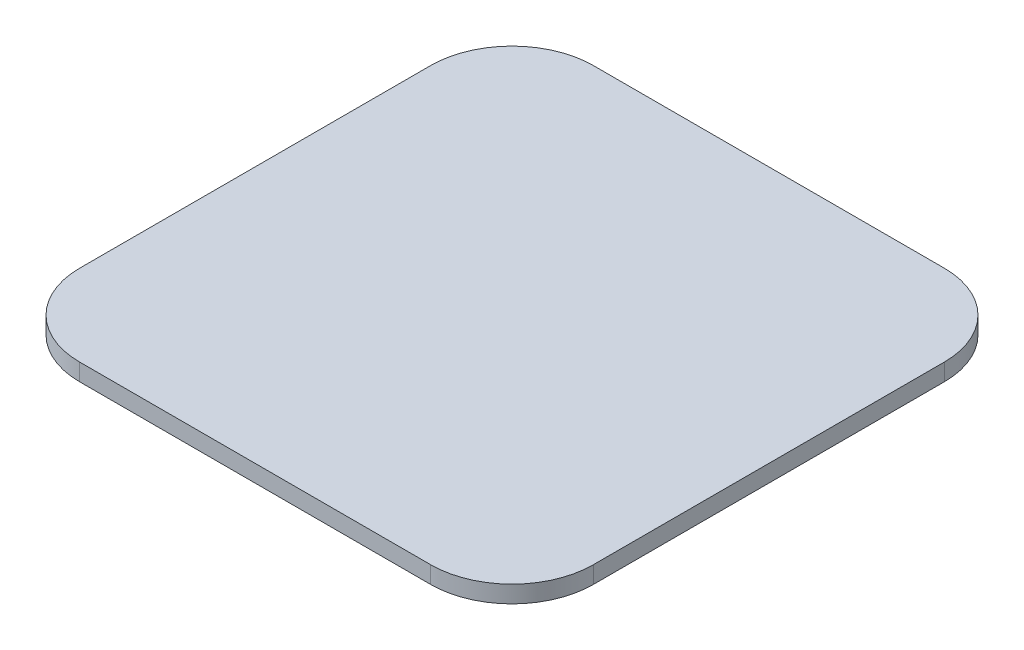
ISO-10303-21;
HEADER;
FILE_DESCRIPTION(('STEP AP214'),'2;1');
FILE_NAME('part.step','',(''),(''),'','','');
FILE_SCHEMA(('AUTOMOTIVE_DESIGN { 1 0 10303 214 1 1 1 1 }'));
ENDSEC;
DATA;
#1=APPLICATION_CONTEXT('core data for automotive mechanical design processes');
#2=APPLICATION_PROTOCOL_DEFINITION('international standard','automotive_design',2000,#1);
#3=PRODUCT_CONTEXT('',#1,'mechanical');
#4=PRODUCT('Part','Part','',(#3));
#5=PRODUCT_RELATED_PRODUCT_CATEGORY('part','',(#4));
#6=PRODUCT_DEFINITION_FORMATION('','',#4);
#7=PRODUCT_DEFINITION_CONTEXT('part definition',#1,'design');
#8=PRODUCT_DEFINITION('design','',#6,#7);
#9=PRODUCT_DEFINITION_SHAPE('','',#8);
#10=(LENGTH_UNIT() NAMED_UNIT(*) SI_UNIT(.MILLI.,.METRE.));
#11=(NAMED_UNIT(*) PLANE_ANGLE_UNIT() SI_UNIT($,.RADIAN.));
#12=(NAMED_UNIT(*) SI_UNIT($,.STERADIAN.) SOLID_ANGLE_UNIT());
#13=UNCERTAINTY_MEASURE_WITH_UNIT(LENGTH_MEASURE(1.E-05),#10,'distance_accuracy_value','');
#14=(GEOMETRIC_REPRESENTATION_CONTEXT(3) GLOBAL_UNCERTAINTY_ASSIGNED_CONTEXT((#13)) GLOBAL_UNIT_ASSIGNED_CONTEXT((#10,
#11,#12)) REPRESENTATION_CONTEXT('',''));
#15=CARTESIAN_POINT('',(0.,0.,0.));
#16=DIRECTION('',(0.,0.,1.));
#17=DIRECTION('',(1.,0.,0.));
#18=AXIS2_PLACEMENT_3D('',#15,#16,#17);
#19=CARTESIAN_POINT('',(0.,4.,0.));
#20=DIRECTION('',(1.,0.,0.));
#21=DIRECTION('',(0.,0.,-1.));
#22=AXIS2_PLACEMENT_3D('',#19,#20,#21);
#23=PLANE('',#22);
#24=DIRECTION('',(0.,0.,1.));
#25=VECTOR('',#24,1.);
#26=CARTESIAN_POINT('',(0.,4.,0.));
#27=LINE('',#26,#25);
#28=CARTESIAN_POINT('',(0.,4.,-101.));
#29=VERTEX_POINT('',#28);
#30=CARTESIAN_POINT('',(0.,4.,-19.));
#31=VERTEX_POINT('',#30);
#32=EDGE_CURVE('E117',#29,#31,#27,.T.);
#33=ORIENTED_EDGE('',*,*,#32,.F.);
#34=DIRECTION('',(0.,-1.,0.));
#35=VECTOR('',#34,1.);
#36=CARTESIAN_POINT('',(0.,4.,-101.));
#37=LINE('',#36,#35);
#38=CARTESIAN_POINT('',(0.,0.,-101.));
#39=VERTEX_POINT('',#38);
#40=EDGE_CURVE('E102',#29,#39,#37,.T.);
#41=ORIENTED_EDGE('',*,*,#40,.T.);
#42=DIRECTION('',(0.,0.,1.));
#43=VECTOR('',#42,1.);
#44=CARTESIAN_POINT('',(0.,0.,0.));
#45=LINE('',#44,#43);
#46=CARTESIAN_POINT('',(0.,0.,-19.));
#47=VERTEX_POINT('',#46);
#48=EDGE_CURVE('E114',#39,#47,#45,.T.);
#49=ORIENTED_EDGE('',*,*,#48,.T.);
#50=DIRECTION('',(0.,-1.,0.));
#51=VECTOR('',#50,1.);
#52=CARTESIAN_POINT('',(0.,4.,-19.));
#53=LINE('',#52,#51);
#54=EDGE_CURVE('E119',#47,#31,#53,.F.);
#55=ORIENTED_EDGE('',*,*,#54,.T.);
#56=EDGE_LOOP('',(#33,#41,#49,#55));
#57=FACE_BOUND('',#56,.T.);
#58=ADVANCED_FACE('F32',(#57),#23,.F.);
#59=CARTESIAN_POINT('',(0.,4.,0.));
#60=DIRECTION('',(0.,0.,-1.));
#61=DIRECTION('',(-1.,0.,0.));
#62=AXIS2_PLACEMENT_3D('',#59,#60,#61);
#63=PLANE('',#62);
#64=DIRECTION('',(1.,0.,0.));
#65=VECTOR('',#64,1.);
#66=CARTESIAN_POINT('',(0.,0.,0.));
#67=LINE('',#66,#65);
#68=CARTESIAN_POINT('',(19.,0.,0.));
#69=VERTEX_POINT('',#68);
#70=CARTESIAN_POINT('',(101.,0.,0.));
#71=VERTEX_POINT('',#70);
#72=EDGE_CURVE('E123',#69,#71,#67,.T.);
#73=ORIENTED_EDGE('',*,*,#72,.T.);
#74=DIRECTION('',(0.,-1.,0.));
#75=VECTOR('',#74,1.);
#76=CARTESIAN_POINT('',(101.,4.,0.));
#77=LINE('',#76,#75);
#78=CARTESIAN_POINT('',(101.,4.,0.));
#79=VERTEX_POINT('',#78);
#80=EDGE_CURVE('E11',#71,#79,#77,.F.);
#81=ORIENTED_EDGE('',*,*,#80,.T.);
#82=DIRECTION('',(1.,0.,0.));
#83=VECTOR('',#82,1.);
#84=CARTESIAN_POINT('',(0.,4.,0.));
#85=LINE('',#84,#83);
#86=CARTESIAN_POINT('',(19.,4.,0.));
#87=VERTEX_POINT('',#86);
#88=EDGE_CURVE('E159',#87,#79,#85,.T.);
#89=ORIENTED_EDGE('',*,*,#88,.F.);
#90=DIRECTION('',(0.,-1.,0.));
#91=VECTOR('',#90,1.);
#92=CARTESIAN_POINT('',(19.,4.,0.));
#93=LINE('',#92,#91);
#94=EDGE_CURVE('E40',#87,#69,#93,.T.);
#95=ORIENTED_EDGE('',*,*,#94,.T.);
#96=EDGE_LOOP('',(#73,#81,#89,#95));
#97=FACE_BOUND('',#96,.T.);
#98=ADVANCED_FACE('F157',(#97),#63,.F.);
#99=CARTESIAN_POINT('',(120.,4.,0.));
#100=DIRECTION('',(-1.,0.,0.));
#101=DIRECTION('',(0.,0.,1.));
#102=AXIS2_PLACEMENT_3D('',#99,#100,#101);
#103=PLANE('',#102);
#104=DIRECTION('',(0.,0.,-1.));
#105=VECTOR('',#104,1.);
#106=CARTESIAN_POINT('',(120.,0.,0.));
#107=LINE('',#106,#105);
#108=CARTESIAN_POINT('',(120.,0.,-19.));
#109=VERTEX_POINT('',#108);
#110=CARTESIAN_POINT('',(120.,0.,-101.));
#111=VERTEX_POINT('',#110);
#112=EDGE_CURVE('E126',#109,#111,#107,.T.);
#113=ORIENTED_EDGE('',*,*,#112,.T.);
#114=DIRECTION('',(0.,-1.,0.));
#115=VECTOR('',#114,1.);
#116=CARTESIAN_POINT('',(120.,4.,-101.));
#117=LINE('',#116,#115);
#118=CARTESIAN_POINT('',(120.,4.,-101.));
#119=VERTEX_POINT('',#118);
#120=EDGE_CURVE('E47',#111,#119,#117,.F.);
#121=ORIENTED_EDGE('',*,*,#120,.T.);
#122=DIRECTION('',(0.,0.,-1.));
#123=VECTOR('',#122,1.);
#124=CARTESIAN_POINT('',(120.,4.,0.));
#125=LINE('',#124,#123);
#126=CARTESIAN_POINT('',(120.,4.,-19.));
#127=VERTEX_POINT('',#126);
#128=EDGE_CURVE('E167',#127,#119,#125,.T.);
#129=ORIENTED_EDGE('',*,*,#128,.F.);
#130=DIRECTION('',(0.,-1.,0.));
#131=VECTOR('',#130,1.);
#132=CARTESIAN_POINT('',(120.,4.,-19.));
#133=LINE('',#132,#131);
#134=EDGE_CURVE('E150',#127,#109,#133,.T.);
#135=ORIENTED_EDGE('',*,*,#134,.T.);
#136=EDGE_LOOP('',(#113,#121,#129,#135));
#137=FACE_BOUND('',#136,.T.);
#138=ADVANCED_FACE('F166',(#137),#103,.F.);
#139=CARTESIAN_POINT('',(0.,4.,-120.));
#140=DIRECTION('',(0.,0.,1.));
#141=DIRECTION('',(1.,0.,0.));
#142=AXIS2_PLACEMENT_3D('',#139,#140,#141);
#143=PLANE('',#142);
#144=DIRECTION('',(-1.,0.,0.));
#145=VECTOR('',#144,1.);
#146=CARTESIAN_POINT('',(0.,0.,-120.));
#147=LINE('',#146,#145);
#148=CARTESIAN_POINT('',(101.,0.,-120.));
#149=VERTEX_POINT('',#148);
#150=CARTESIAN_POINT('',(19.,0.,-120.));
#151=VERTEX_POINT('',#150);
#152=EDGE_CURVE('E133',#149,#151,#147,.T.);
#153=ORIENTED_EDGE('',*,*,#152,.T.);
#154=DIRECTION('',(0.,-1.,0.));
#155=VECTOR('',#154,1.);
#156=CARTESIAN_POINT('',(19.,4.,-120.));
#157=LINE('',#156,#155);
#158=CARTESIAN_POINT('',(19.,4.,-120.));
#159=VERTEX_POINT('',#158);
#160=EDGE_CURVE('E103',#151,#159,#157,.F.);
#161=ORIENTED_EDGE('',*,*,#160,.T.);
#162=DIRECTION('',(-1.,0.,0.));
#163=VECTOR('',#162,1.);
#164=CARTESIAN_POINT('',(0.,4.,-120.));
#165=LINE('',#164,#163);
#166=CARTESIAN_POINT('',(101.,4.,-120.));
#167=VERTEX_POINT('',#166);
#168=EDGE_CURVE('E129',#167,#159,#165,.T.);
#169=ORIENTED_EDGE('',*,*,#168,.F.);
#170=DIRECTION('',(0.,-1.,0.));
#171=VECTOR('',#170,1.);
#172=CARTESIAN_POINT('',(101.,4.,-120.));
#173=LINE('',#172,#171);
#174=EDGE_CURVE('E108',#167,#149,#173,.T.);
#175=ORIENTED_EDGE('',*,*,#174,.T.);
#176=EDGE_LOOP('',(#153,#161,#169,#175));
#177=FACE_BOUND('',#176,.T.);
#178=ADVANCED_FACE('F195',(#177),#143,.F.);
#179=CARTESIAN_POINT('',(0.,4.,0.));
#180=DIRECTION('',(0.,-1.,0.));
#181=DIRECTION('',(0.,0.,-1.));
#182=AXIS2_PLACEMENT_3D('',#179,#180,#181);
#183=PLANE('',#182);
#184=ORIENTED_EDGE('',*,*,#168,.T.);
#185=CARTESIAN_POINT('',(19.,4.,-101.));
#186=DIRECTION('',(0.,-1.,0.));
#187=DIRECTION('',(0.,0.,-1.));
#188=AXIS2_PLACEMENT_3D('',#185,#186,#187);
#189=CIRCLE('',#188,19.);
#190=EDGE_CURVE('E148',#159,#29,#189,.F.);
#191=ORIENTED_EDGE('',*,*,#190,.T.);
#192=ORIENTED_EDGE('',*,*,#32,.T.);
#193=CARTESIAN_POINT('',(19.,4.,-19.));
#194=DIRECTION('',(0.,-1.,0.));
#195=DIRECTION('',(0.,0.,-1.));
#196=AXIS2_PLACEMENT_3D('',#193,#194,#195);
#197=CIRCLE('',#196,19.);
#198=EDGE_CURVE('E143',#31,#87,#197,.F.);
#199=ORIENTED_EDGE('',*,*,#198,.T.);
#200=ORIENTED_EDGE('',*,*,#88,.T.);
#201=CARTESIAN_POINT('',(101.,4.,-19.));
#202=DIRECTION('',(0.,-1.,0.));
#203=DIRECTION('',(0.,0.,-1.));
#204=AXIS2_PLACEMENT_3D('',#201,#202,#203);
#205=CIRCLE('',#204,19.);
#206=EDGE_CURVE('E54',#79,#127,#205,.F.);
#207=ORIENTED_EDGE('',*,*,#206,.T.);
#208=ORIENTED_EDGE('',*,*,#128,.T.);
#209=CARTESIAN_POINT('',(101.,4.,-101.));
#210=DIRECTION('',(0.,-1.,0.));
#211=DIRECTION('',(0.,0.,-1.));
#212=AXIS2_PLACEMENT_3D('',#209,#210,#211);
#213=CIRCLE('',#212,19.);
#214=EDGE_CURVE('E146',#119,#167,#213,.F.);
#215=ORIENTED_EDGE('',*,*,#214,.T.);
#216=EDGE_LOOP('',(#184,#191,#192,#199,#200,#207,#208,#215));
#217=FACE_BOUND('',#216,.T.);
#218=ADVANCED_FACE('F172',(#217),#183,.F.);
#219=CARTESIAN_POINT('',(0.,0.,0.));
#220=DIRECTION('',(0.,-1.,0.));
#221=DIRECTION('',(0.,0.,-1.));
#222=AXIS2_PLACEMENT_3D('',#219,#220,#221);
#223=PLANE('',#222);
#224=ORIENTED_EDGE('',*,*,#48,.F.);
#225=CARTESIAN_POINT('',(19.,0.,-101.));
#226=DIRECTION('',(0.,-1.,0.));
#227=DIRECTION('',(0.,0.,-1.));
#228=AXIS2_PLACEMENT_3D('',#225,#226,#227);
#229=CIRCLE('',#228,19.);
#230=EDGE_CURVE('E98',#39,#151,#229,.T.);
#231=ORIENTED_EDGE('',*,*,#230,.T.);
#232=ORIENTED_EDGE('',*,*,#152,.F.);
#233=CARTESIAN_POINT('',(101.,0.,-101.));
#234=DIRECTION('',(0.,-1.,0.));
#235=DIRECTION('',(0.,0.,-1.));
#236=AXIS2_PLACEMENT_3D('',#233,#234,#235);
#237=CIRCLE('',#236,19.);
#238=EDGE_CURVE('E109',#149,#111,#237,.T.);
#239=ORIENTED_EDGE('',*,*,#238,.T.);
#240=ORIENTED_EDGE('',*,*,#112,.F.);
#241=CARTESIAN_POINT('',(101.,0.,-19.));
#242=DIRECTION('',(0.,-1.,0.));
#243=DIRECTION('',(0.,0.,-1.));
#244=AXIS2_PLACEMENT_3D('',#241,#242,#243);
#245=CIRCLE('',#244,19.);
#246=EDGE_CURVE('E137',#109,#71,#245,.T.);
#247=ORIENTED_EDGE('',*,*,#246,.T.);
#248=ORIENTED_EDGE('',*,*,#72,.F.);
#249=CARTESIAN_POINT('',(19.,0.,-19.));
#250=DIRECTION('',(0.,-1.,0.));
#251=DIRECTION('',(0.,0.,-1.));
#252=AXIS2_PLACEMENT_3D('',#249,#250,#251);
#253=CIRCLE('',#252,19.);
#254=EDGE_CURVE('E118',#69,#47,#253,.T.);
#255=ORIENTED_EDGE('',*,*,#254,.T.);
#256=EDGE_LOOP('',(#224,#231,#232,#239,#240,#247,#248,#255));
#257=FACE_BOUND('',#256,.T.);
#258=ADVANCED_FACE('F121',(#257),#223,.T.);
#259=CARTESIAN_POINT('',(19.,4.,-101.));
#260=DIRECTION('',(0.,-1.,0.));
#261=DIRECTION('',(0.,0.,-1.));
#262=AXIS2_PLACEMENT_3D('',#259,#260,#261);
#263=CYLINDRICAL_SURFACE('',#262,19.);
#264=ORIENTED_EDGE('',*,*,#190,.F.);
#265=ORIENTED_EDGE('',*,*,#160,.F.);
#266=ORIENTED_EDGE('',*,*,#230,.F.);
#267=ORIENTED_EDGE('',*,*,#40,.F.);
#268=EDGE_LOOP('',(#264,#265,#266,#267));
#269=FACE_BOUND('',#268,.T.);
#270=ADVANCED_FACE('F101',(#269),#263,.T.);
#271=CARTESIAN_POINT('',(101.,4.,-101.));
#272=DIRECTION('',(0.,-1.,0.));
#273=DIRECTION('',(0.,0.,-1.));
#274=AXIS2_PLACEMENT_3D('',#271,#272,#273);
#275=CYLINDRICAL_SURFACE('',#274,19.);
#276=ORIENTED_EDGE('',*,*,#214,.F.);
#277=ORIENTED_EDGE('',*,*,#120,.F.);
#278=ORIENTED_EDGE('',*,*,#238,.F.);
#279=ORIENTED_EDGE('',*,*,#174,.F.);
#280=EDGE_LOOP('',(#276,#277,#278,#279));
#281=FACE_BOUND('',#280,.T.);
#282=ADVANCED_FACE('F177',(#281),#275,.T.);
#283=CARTESIAN_POINT('',(101.,4.,-19.));
#284=DIRECTION('',(0.,-1.,0.));
#285=DIRECTION('',(0.,0.,-1.));
#286=AXIS2_PLACEMENT_3D('',#283,#284,#285);
#287=CYLINDRICAL_SURFACE('',#286,19.);
#288=ORIENTED_EDGE('',*,*,#206,.F.);
#289=ORIENTED_EDGE('',*,*,#80,.F.);
#290=ORIENTED_EDGE('',*,*,#246,.F.);
#291=ORIENTED_EDGE('',*,*,#134,.F.);
#292=EDGE_LOOP('',(#288,#289,#290,#291));
#293=FACE_BOUND('',#292,.T.);
#294=ADVANCED_FACE('F165',(#293),#287,.T.);
#295=CARTESIAN_POINT('',(19.,4.,-19.));
#296=DIRECTION('',(0.,-1.,0.));
#297=DIRECTION('',(0.,0.,-1.));
#298=AXIS2_PLACEMENT_3D('',#295,#296,#297);
#299=CYLINDRICAL_SURFACE('',#298,19.);
#300=ORIENTED_EDGE('',*,*,#198,.F.);
#301=ORIENTED_EDGE('',*,*,#54,.F.);
#302=ORIENTED_EDGE('',*,*,#254,.F.);
#303=ORIENTED_EDGE('',*,*,#94,.F.);
#304=EDGE_LOOP('',(#300,#301,#302,#303));
#305=FACE_BOUND('',#304,.T.);
#306=ADVANCED_FACE('F34',(#305),#299,.T.);
#307=CLOSED_SHELL('',(#58,#98,#138,#178,#218,#258,#270,#282,#294,#306));
#308=MANIFOLD_SOLID_BREP('B2',#307);
#309=ADVANCED_BREP_SHAPE_REPRESENTATION('',(#18,#308),#14);
#310=SHAPE_DEFINITION_REPRESENTATION(#9,#309);
ENDSEC;
END-ISO-10303-21;
